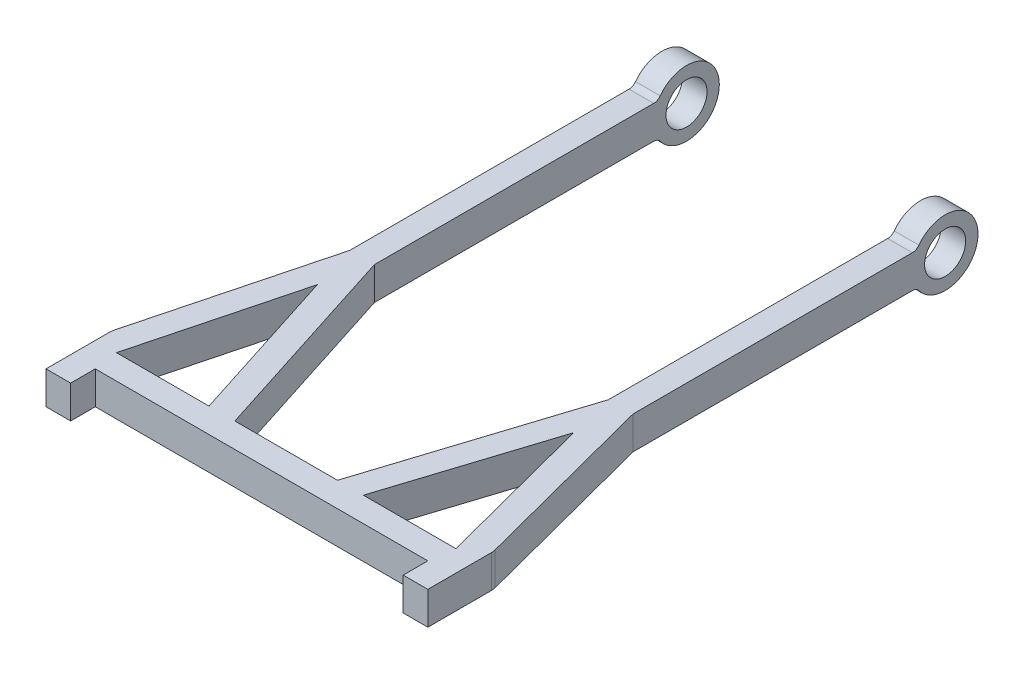
ISO-10303-21;
HEADER;
FILE_DESCRIPTION(('STEP AP214'),'2;1');
FILE_NAME('part.step','',(''),(''),'','','');
FILE_SCHEMA(('AUTOMOTIVE_DESIGN { 1 0 10303 214 1 1 1 1 }'));
ENDSEC;
DATA;
#1=APPLICATION_CONTEXT('core data for automotive mechanical design processes');
#2=APPLICATION_PROTOCOL_DEFINITION('international standard','automotive_design',2000,#1);
#3=PRODUCT_CONTEXT('',#1,'mechanical');
#4=PRODUCT('Part','Part','',(#3));
#5=PRODUCT_RELATED_PRODUCT_CATEGORY('part','',(#4));
#6=PRODUCT_DEFINITION_FORMATION('','',#4);
#7=PRODUCT_DEFINITION_CONTEXT('part definition',#1,'design');
#8=PRODUCT_DEFINITION('design','',#6,#7);
#9=PRODUCT_DEFINITION_SHAPE('','',#8);
#10=(LENGTH_UNIT() NAMED_UNIT(*) SI_UNIT(.MILLI.,.METRE.));
#11=(NAMED_UNIT(*) PLANE_ANGLE_UNIT() SI_UNIT($,.RADIAN.));
#12=(NAMED_UNIT(*) SI_UNIT($,.STERADIAN.) SOLID_ANGLE_UNIT());
#13=UNCERTAINTY_MEASURE_WITH_UNIT(LENGTH_MEASURE(1.E-05),#10,'distance_accuracy_value','');
#14=(GEOMETRIC_REPRESENTATION_CONTEXT(3) GLOBAL_UNCERTAINTY_ASSIGNED_CONTEXT((#13)) GLOBAL_UNIT_ASSIGNED_CONTEXT((#10,
#11,#12)) REPRESENTATION_CONTEXT('',''));
#15=CARTESIAN_POINT('',(0.,0.,0.));
#16=DIRECTION('',(0.,0.,1.));
#17=DIRECTION('',(1.,0.,0.));
#18=AXIS2_PLACEMENT_3D('',#15,#16,#17);
#19=CARTESIAN_POINT('',(-10.625,1.,-1.62171189199843));
#20=DIRECTION('',(0.,-1.,0.));
#21=DIRECTION('',(0.,0.,-1.));
#22=AXIS2_PLACEMENT_3D('',#19,#20,#21);
#23=PLANE('',#22);
#24=DIRECTION('',(0.,0.,1.));
#25=VECTOR('',#24,1.);
#26=CARTESIAN_POINT('',(-8.625,1.,-30.25));
#27=LINE('',#26,#25);
#28=CARTESIAN_POINT('',(-8.625,1.,-30.25));
#29=VERTEX_POINT('',#28);
#30=CARTESIAN_POINT('',(-8.625,1.,-13.25));
#31=VERTEX_POINT('',#30);
#32=EDGE_CURVE('E264',#29,#31,#27,.T.);
#33=ORIENTED_EDGE('',*,*,#32,.T.);
#34=DIRECTION('',(-0.252421897147003,0.,0.967617272396844));
#35=VECTOR('',#34,1.);
#36=CARTESIAN_POINT('',(-11.5926172723968,1.,-1.87413378914544));
#37=LINE('',#36,#35);
#38=CARTESIAN_POINT('',(-11.5926172723968,1.,-1.87413378914544));
#39=VERTEX_POINT('',#38);
#40=EDGE_CURVE('E408',#31,#39,#37,.T.);
#41=ORIENTED_EDGE('',*,*,#40,.T.);
#42=CARTESIAN_POINT('',(-10.625,1.,-1.62171189199843));
#43=DIRECTION('',(0.,1.,0.));
#44=DIRECTION('',(0.,0.,-1.));
#45=AXIS2_PLACEMENT_3D('',#42,#43,#44);
#46=CIRCLE('',#45,0.999999999999999);
#47=CARTESIAN_POINT('',(-11.625,1.,-1.62171189199843));
#48=VERTEX_POINT('',#47);
#49=EDGE_CURVE('E411',#39,#48,#46,.T.);
#50=ORIENTED_EDGE('',*,*,#49,.T.);
#51=DIRECTION('',(0.,0.,1.));
#52=VECTOR('',#51,1.);
#53=CARTESIAN_POINT('',(-11.625,1.,0.75));
#54=LINE('',#53,#52);
#55=CARTESIAN_POINT('',(-11.625,1.,2.25));
#56=VERTEX_POINT('',#55);
#57=EDGE_CURVE('E413',#48,#56,#54,.T.);
#58=ORIENTED_EDGE('',*,*,#57,.T.);
#59=DIRECTION('',(1.,0.,0.));
#60=VECTOR('',#59,1.);
#61=CARTESIAN_POINT('',(-11.625,1.,2.25));
#62=LINE('',#61,#60);
#63=CARTESIAN_POINT('',(-10.125,1.,2.25));
#64=VERTEX_POINT('',#63);
#65=EDGE_CURVE('E415',#56,#64,#62,.T.);
#66=ORIENTED_EDGE('',*,*,#65,.T.);
#67=DIRECTION('',(0.,0.,-1.));
#68=VECTOR('',#67,1.);
#69=CARTESIAN_POINT('',(-10.125,1.,2.25));
#70=LINE('',#69,#68);
#71=CARTESIAN_POINT('',(-10.125,1.,0.75));
#72=VERTEX_POINT('',#71);
#73=EDGE_CURVE('E417',#64,#72,#70,.T.);
#74=ORIENTED_EDGE('',*,*,#73,.T.);
#75=DIRECTION('',(1.,0.,0.));
#76=VECTOR('',#75,1.);
#77=CARTESIAN_POINT('',(-10.125,1.,0.75));
#78=LINE('',#77,#76);
#79=CARTESIAN_POINT('',(10.125,1.,0.75));
#80=VERTEX_POINT('',#79);
#81=EDGE_CURVE('E419',#72,#80,#78,.T.);
#82=ORIENTED_EDGE('',*,*,#81,.T.);
#83=DIRECTION('',(0.,0.,-1.));
#84=VECTOR('',#83,1.);
#85=CARTESIAN_POINT('',(10.125,1.,2.25));
#86=LINE('',#85,#84);
#87=CARTESIAN_POINT('',(10.125,1.,2.25));
#88=VERTEX_POINT('',#87);
#89=EDGE_CURVE('E330',#88,#80,#86,.T.);
#90=ORIENTED_EDGE('',*,*,#89,.F.);
#91=DIRECTION('',(-1.,0.,0.));
#92=VECTOR('',#91,1.);
#93=CARTESIAN_POINT('',(11.625,1.,2.25));
#94=LINE('',#93,#92);
#95=CARTESIAN_POINT('',(11.625,1.,2.25));
#96=VERTEX_POINT('',#95);
#97=EDGE_CURVE('E333',#96,#88,#94,.T.);
#98=ORIENTED_EDGE('',*,*,#97,.F.);
#99=DIRECTION('',(0.,0.,1.));
#100=VECTOR('',#99,1.);
#101=CARTESIAN_POINT('',(11.625,1.,2.25));
#102=LINE('',#101,#100);
#103=CARTESIAN_POINT('',(11.625,1.,-1.62171189199843));
#104=VERTEX_POINT('',#103);
#105=EDGE_CURVE('E336',#104,#96,#102,.T.);
#106=ORIENTED_EDGE('',*,*,#105,.F.);
#107=CARTESIAN_POINT('',(10.625,1.,-1.62171189199843));
#108=DIRECTION('',(0.,-1.,0.));
#109=DIRECTION('',(0.,0.,-1.));
#110=AXIS2_PLACEMENT_3D('',#107,#108,#109);
#111=CIRCLE('',#110,0.999999999999999);
#112=CARTESIAN_POINT('',(11.5926172723968,1.,-1.87413378914544));
#113=VERTEX_POINT('',#112);
#114=EDGE_CURVE('E339',#113,#104,#111,.T.);
#115=ORIENTED_EDGE('',*,*,#114,.F.);
#116=DIRECTION('',(0.252421897147003,0.,0.967617272396844));
#117=VECTOR('',#116,1.);
#118=CARTESIAN_POINT('',(11.5926172723968,1.,-1.87413378914544));
#119=LINE('',#118,#117);
#120=CARTESIAN_POINT('',(8.625,1.,-13.25));
#121=VERTEX_POINT('',#120);
#122=EDGE_CURVE('E342',#121,#113,#119,.T.);
#123=ORIENTED_EDGE('',*,*,#122,.F.);
#124=DIRECTION('',(0.,0.,1.));
#125=VECTOR('',#124,1.);
#126=CARTESIAN_POINT('',(8.625,1.,-30.25));
#127=LINE('',#126,#125);
#128=CARTESIAN_POINT('',(8.625,1.,-30.25));
#129=VERTEX_POINT('',#128);
#130=EDGE_CURVE('E318',#129,#121,#127,.T.);
#131=ORIENTED_EDGE('',*,*,#130,.F.);
#132=DIRECTION('',(1.,0.,0.));
#133=VECTOR('',#132,1.);
#134=CARTESIAN_POINT('',(8.625,1.,-30.25));
#135=LINE('',#134,#133);
#136=CARTESIAN_POINT('',(7.125,1.,-30.25));
#137=VERTEX_POINT('',#136);
#138=EDGE_CURVE('E321',#137,#129,#135,.T.);
#139=ORIENTED_EDGE('',*,*,#138,.F.);
#140=DIRECTION('',(0.,0.,-1.));
#141=VECTOR('',#140,1.);
#142=CARTESIAN_POINT('',(7.125,1.,-30.25));
#143=LINE('',#142,#141);
#144=CARTESIAN_POINT('',(7.125,1.,-13.25));
#145=VERTEX_POINT('',#144);
#146=EDGE_CURVE('E324',#145,#137,#143,.T.);
#147=ORIENTED_EDGE('',*,*,#146,.F.);
#148=DIRECTION('',(0.304775727103784,0.,-0.952424147199324));
#149=VECTOR('',#148,1.);
#150=CARTESIAN_POINT('',(3.125,1.,-0.75));
#151=LINE('',#150,#149);
#152=CARTESIAN_POINT('',(3.125,1.,-0.75));
#153=VERTEX_POINT('',#152);
#154=EDGE_CURVE('E327',#153,#145,#151,.T.);
#155=ORIENTED_EDGE('',*,*,#154,.F.);
#156=DIRECTION('',(-1.,0.,0.));
#157=VECTOR('',#156,1.);
#158=CARTESIAN_POINT('',(-3.125,1.,-0.75));
#159=LINE('',#158,#157);
#160=CARTESIAN_POINT('',(-3.125,1.,-0.75));
#161=VERTEX_POINT('',#160);
#162=EDGE_CURVE('E421',#153,#161,#159,.T.);
#163=ORIENTED_EDGE('',*,*,#162,.T.);
#164=DIRECTION('',(-0.304775727103784,0.,-0.952424147199324));
#165=VECTOR('',#164,1.);
#166=CARTESIAN_POINT('',(-3.125,1.,-0.75));
#167=LINE('',#166,#165);
#168=CARTESIAN_POINT('',(-7.125,1.,-13.25));
#169=VERTEX_POINT('',#168);
#170=EDGE_CURVE('E423',#161,#169,#167,.T.);
#171=ORIENTED_EDGE('',*,*,#170,.T.);
#172=DIRECTION('',(0.,0.,-1.));
#173=VECTOR('',#172,1.);
#174=CARTESIAN_POINT('',(-7.125,1.,-30.25));
#175=LINE('',#174,#173);
#176=CARTESIAN_POINT('',(-7.125,1.,-30.25));
#177=VERTEX_POINT('',#176);
#178=EDGE_CURVE('E425',#169,#177,#175,.T.);
#179=ORIENTED_EDGE('',*,*,#178,.T.);
#180=DIRECTION('',(-1.,0.,0.));
#181=VECTOR('',#180,1.);
#182=CARTESIAN_POINT('',(-8.625,1.,-30.25));
#183=LINE('',#182,#181);
#184=EDGE_CURVE('E427',#177,#29,#183,.T.);
#185=ORIENTED_EDGE('',*,*,#184,.T.);
#186=EDGE_LOOP('',(#33,#41,#50,#58,#66,#74,#82,#90,#98,#106,#115,#123,#131,#139,#147,#155,#163,
#171,#179,#185));
#187=FACE_BOUND('',#186,.T.);
#188=DIRECTION('',(1.,0.,0.));
#189=VECTOR('',#188,1.);
#190=CARTESIAN_POINT('',(-10.335669870782,1.,-0.750000000000001));
#191=LINE('',#190,#189);
#192=CARTESIAN_POINT('',(-10.335669870782,1.,-0.750000000000001));
#193=VERTEX_POINT('',#192);
#194=CARTESIAN_POINT('',(-4.6999285698088,1.,-0.75));
#195=VERTEX_POINT('',#194);
#196=EDGE_CURVE('E388',#193,#195,#191,.T.);
#197=ORIENTED_EDGE('',*,*,#196,.F.);
#198=DIRECTION('',(-0.252421897147002,0.,0.967617272396844));
#199=VECTOR('',#198,1.);
#200=CARTESIAN_POINT('',(-7.80464832842877,1.,-10.4522492456874));
#201=LINE('',#200,#199);
#202=CARTESIAN_POINT('',(-7.80464832842877,1.,-10.4522492456874));
#203=VERTEX_POINT('',#202);
#204=EDGE_CURVE('E393',#203,#193,#201,.T.);
#205=ORIENTED_EDGE('',*,*,#204,.F.);
#206=DIRECTION('',(-0.304775727103784,0.,-0.952424147199324));
#207=VECTOR('',#206,1.);
#208=CARTESIAN_POINT('',(-4.6999285698088,1.,-0.75));
#209=LINE('',#208,#207);
#210=EDGE_CURVE('E390',#195,#203,#209,.T.);
#211=ORIENTED_EDGE('',*,*,#210,.F.);
#212=EDGE_LOOP('',(#197,#205,#211));
#213=FACE_BOUND('',#212,.T.);
#214=DIRECTION('',(0.252421897147002,0.,0.967617272396844));
#215=VECTOR('',#214,1.);
#216=CARTESIAN_POINT('',(7.80464832842877,1.,-10.4522492456874));
#217=LINE('',#216,#215);
#218=CARTESIAN_POINT('',(7.80464832842877,1.,-10.4522492456874));
#219=VERTEX_POINT('',#218);
#220=CARTESIAN_POINT('',(10.335669870782,1.,-0.750000000000001));
#221=VERTEX_POINT('',#220);
#222=EDGE_CURVE('E297',#219,#221,#217,.T.);
#223=ORIENTED_EDGE('',*,*,#222,.T.);
#224=DIRECTION('',(-1.,0.,0.));
#225=VECTOR('',#224,1.);
#226=CARTESIAN_POINT('',(10.335669870782,1.,-0.750000000000001));
#227=LINE('',#226,#225);
#228=CARTESIAN_POINT('',(4.6999285698088,1.,-0.75));
#229=VERTEX_POINT('',#228);
#230=EDGE_CURVE('E294',#221,#229,#227,.T.);
#231=ORIENTED_EDGE('',*,*,#230,.T.);
#232=DIRECTION('',(0.304775727103784,0.,-0.952424147199324));
#233=VECTOR('',#232,1.);
#234=CARTESIAN_POINT('',(4.6999285698088,1.,-0.75));
#235=LINE('',#234,#233);
#236=EDGE_CURVE('E301',#229,#219,#235,.T.);
#237=ORIENTED_EDGE('',*,*,#236,.T.);
#238=EDGE_LOOP('',(#223,#231,#237));
#239=FACE_BOUND('',#238,.T.);
#240=ADVANCED_FACE('F39',(#187,#213,#239),#23,.F.);
#241=CARTESIAN_POINT('',(-10.625,-1.,-1.62171189199843));
#242=DIRECTION('',(0.,-1.,0.));
#243=DIRECTION('',(0.,0.,-1.));
#244=AXIS2_PLACEMENT_3D('',#241,#242,#243);
#245=PLANE('',#244);
#246=DIRECTION('',(0.,0.,1.));
#247=VECTOR('',#246,1.);
#248=CARTESIAN_POINT('',(-8.625,-1.,-30.25));
#249=LINE('',#248,#247);
#250=CARTESIAN_POINT('',(-8.625,-1.,-30.25));
#251=VERTEX_POINT('',#250);
#252=CARTESIAN_POINT('',(-8.625,-1.,-13.25));
#253=VERTEX_POINT('',#252);
#254=EDGE_CURVE('E406',#251,#253,#249,.T.);
#255=ORIENTED_EDGE('',*,*,#254,.F.);
#256=DIRECTION('',(-1.,0.,0.));
#257=VECTOR('',#256,1.);
#258=CARTESIAN_POINT('',(-8.625,-1.,-30.25));
#259=LINE('',#258,#257);
#260=CARTESIAN_POINT('',(-7.125,-1.,-30.25));
#261=VERTEX_POINT('',#260);
#262=EDGE_CURVE('E409',#261,#251,#259,.T.);
#263=ORIENTED_EDGE('',*,*,#262,.F.);
#264=DIRECTION('',(0.,0.,-1.));
#265=VECTOR('',#264,1.);
#266=CARTESIAN_POINT('',(-7.125,-1.,-30.25));
#267=LINE('',#266,#265);
#268=CARTESIAN_POINT('',(-7.125,-1.,-13.25));
#269=VERTEX_POINT('',#268);
#270=EDGE_CURVE('E448',#269,#261,#267,.T.);
#271=ORIENTED_EDGE('',*,*,#270,.F.);
#272=DIRECTION('',(-0.304775727103784,0.,-0.952424147199324));
#273=VECTOR('',#272,1.);
#274=CARTESIAN_POINT('',(-3.125,-1.,-0.75));
#275=LINE('',#274,#273);
#276=CARTESIAN_POINT('',(-3.125,-1.,-0.75));
#277=VERTEX_POINT('',#276);
#278=EDGE_CURVE('E446',#277,#269,#275,.T.);
#279=ORIENTED_EDGE('',*,*,#278,.F.);
#280=DIRECTION('',(-1.,0.,0.));
#281=VECTOR('',#280,1.);
#282=CARTESIAN_POINT('',(-3.125,-1.,-0.75));
#283=LINE('',#282,#281);
#284=CARTESIAN_POINT('',(3.125,-1.,-0.75));
#285=VERTEX_POINT('',#284);
#286=EDGE_CURVE('E444',#285,#277,#283,.T.);
#287=ORIENTED_EDGE('',*,*,#286,.F.);
#288=DIRECTION('',(0.304775727103784,0.,-0.952424147199324));
#289=VECTOR('',#288,1.);
#290=CARTESIAN_POINT('',(3.125,-1.,-0.75));
#291=LINE('',#290,#289);
#292=CARTESIAN_POINT('',(7.125,-1.,-13.25));
#293=VERTEX_POINT('',#292);
#294=EDGE_CURVE('E354',#285,#293,#291,.T.);
#295=ORIENTED_EDGE('',*,*,#294,.T.);
#296=DIRECTION('',(0.,0.,-1.));
#297=VECTOR('',#296,1.);
#298=CARTESIAN_POINT('',(7.125,-1.,-30.25));
#299=LINE('',#298,#297);
#300=CARTESIAN_POINT('',(7.125,-1.,-30.25));
#301=VERTEX_POINT('',#300);
#302=EDGE_CURVE('E351',#293,#301,#299,.T.);
#303=ORIENTED_EDGE('',*,*,#302,.T.);
#304=DIRECTION('',(1.,0.,0.));
#305=VECTOR('',#304,1.);
#306=CARTESIAN_POINT('',(8.625,-1.,-30.25));
#307=LINE('',#306,#305);
#308=CARTESIAN_POINT('',(8.625,-1.,-30.25));
#309=VERTEX_POINT('',#308);
#310=EDGE_CURVE('E348',#301,#309,#307,.T.);
#311=ORIENTED_EDGE('',*,*,#310,.T.);
#312=DIRECTION('',(0.,0.,1.));
#313=VECTOR('',#312,1.);
#314=CARTESIAN_POINT('',(8.625,-1.,-30.25));
#315=LINE('',#314,#313);
#316=CARTESIAN_POINT('',(8.625,-1.,-13.25));
#317=VERTEX_POINT('',#316);
#318=EDGE_CURVE('E317',#309,#317,#315,.T.);
#319=ORIENTED_EDGE('',*,*,#318,.T.);
#320=DIRECTION('',(0.252421897147003,0.,0.967617272396844));
#321=VECTOR('',#320,1.);
#322=CARTESIAN_POINT('',(11.5926172723968,-1.,-1.87413378914544));
#323=LINE('',#322,#321);
#324=CARTESIAN_POINT('',(11.5926172723968,-1.,-1.87413378914544));
#325=VERTEX_POINT('',#324);
#326=EDGE_CURVE('E322',#317,#325,#323,.T.);
#327=ORIENTED_EDGE('',*,*,#326,.T.);
#328=CARTESIAN_POINT('',(10.625,-1.,-1.62171189199843));
#329=DIRECTION('',(0.,-1.,0.));
#330=DIRECTION('',(0.,0.,-1.));
#331=AXIS2_PLACEMENT_3D('',#328,#329,#330);
#332=CIRCLE('',#331,0.999999999999999);
#333=CARTESIAN_POINT('',(11.625,-1.,-1.62171189199843));
#334=VERTEX_POINT('',#333);
#335=EDGE_CURVE('E365',#325,#334,#332,.T.);
#336=ORIENTED_EDGE('',*,*,#335,.T.);
#337=DIRECTION('',(0.,0.,1.));
#338=VECTOR('',#337,1.);
#339=CARTESIAN_POINT('',(11.625,-1.,0.75));
#340=LINE('',#339,#338);
#341=CARTESIAN_POINT('',(11.625,-1.,2.25));
#342=VERTEX_POINT('',#341);
#343=EDGE_CURVE('E363',#334,#342,#340,.T.);
#344=ORIENTED_EDGE('',*,*,#343,.T.);
#345=DIRECTION('',(-1.,0.,0.));
#346=VECTOR('',#345,1.);
#347=CARTESIAN_POINT('',(11.625,-1.,2.25));
#348=LINE('',#347,#346);
#349=CARTESIAN_POINT('',(10.125,-1.,2.25));
#350=VERTEX_POINT('',#349);
#351=EDGE_CURVE('E360',#342,#350,#348,.T.);
#352=ORIENTED_EDGE('',*,*,#351,.T.);
#353=DIRECTION('',(0.,0.,-1.));
#354=VECTOR('',#353,1.);
#355=CARTESIAN_POINT('',(10.125,-1.,2.25));
#356=LINE('',#355,#354);
#357=CARTESIAN_POINT('',(10.125,-1.,0.75));
#358=VERTEX_POINT('',#357);
#359=EDGE_CURVE('E357',#350,#358,#356,.T.);
#360=ORIENTED_EDGE('',*,*,#359,.T.);
#361=DIRECTION('',(1.,0.,0.));
#362=VECTOR('',#361,1.);
#363=CARTESIAN_POINT('',(-10.125,-1.,0.75));
#364=LINE('',#363,#362);
#365=CARTESIAN_POINT('',(-10.125,-1.,0.75));
#366=VERTEX_POINT('',#365);
#367=EDGE_CURVE('E442',#366,#358,#364,.T.);
#368=ORIENTED_EDGE('',*,*,#367,.F.);
#369=DIRECTION('',(0.,0.,-1.));
#370=VECTOR('',#369,1.);
#371=CARTESIAN_POINT('',(-10.125,-1.,2.25));
#372=LINE('',#371,#370);
#373=CARTESIAN_POINT('',(-10.125,-1.,2.25));
#374=VERTEX_POINT('',#373);
#375=EDGE_CURVE('E440',#374,#366,#372,.T.);
#376=ORIENTED_EDGE('',*,*,#375,.F.);
#377=DIRECTION('',(1.,0.,0.));
#378=VECTOR('',#377,1.);
#379=CARTESIAN_POINT('',(-11.625,-1.,2.25));
#380=LINE('',#379,#378);
#381=CARTESIAN_POINT('',(-11.625,-1.,2.25));
#382=VERTEX_POINT('',#381);
#383=EDGE_CURVE('E438',#382,#374,#380,.T.);
#384=ORIENTED_EDGE('',*,*,#383,.F.);
#385=DIRECTION('',(0.,0.,1.));
#386=VECTOR('',#385,1.);
#387=CARTESIAN_POINT('',(-11.625,-1.,2.25));
#388=LINE('',#387,#386);
#389=CARTESIAN_POINT('',(-11.625,-1.,-1.62171189199843));
#390=VERTEX_POINT('',#389);
#391=EDGE_CURVE('E436',#390,#382,#388,.T.);
#392=ORIENTED_EDGE('',*,*,#391,.F.);
#393=CARTESIAN_POINT('',(-10.625,-1.,-1.62171189199843));
#394=DIRECTION('',(0.,1.,0.));
#395=DIRECTION('',(0.,0.,-1.));
#396=AXIS2_PLACEMENT_3D('',#393,#394,#395);
#397=CIRCLE('',#396,0.999999999999999);
#398=CARTESIAN_POINT('',(-11.5926172723968,-1.,-1.87413378914544));
#399=VERTEX_POINT('',#398);
#400=EDGE_CURVE('E433',#399,#390,#397,.T.);
#401=ORIENTED_EDGE('',*,*,#400,.F.);
#402=DIRECTION('',(-0.252421897147003,0.,0.967617272396844));
#403=VECTOR('',#402,1.);
#404=CARTESIAN_POINT('',(-11.5926172723968,-1.,-1.87413378914544));
#405=LINE('',#404,#403);
#406=EDGE_CURVE('E431',#253,#399,#405,.T.);
#407=ORIENTED_EDGE('',*,*,#406,.F.);
#408=EDGE_LOOP('',(#255,#263,#271,#279,#287,#295,#303,#311,#319,#327,#336,#344,#352,#360,#368,
#376,#384,#392,#401,#407));
#409=FACE_BOUND('',#408,.T.);
#410=DIRECTION('',(-0.252421897147002,0.,0.967617272396844));
#411=VECTOR('',#410,1.);
#412=CARTESIAN_POINT('',(-7.80464832842877,-1.,-10.4522492456874));
#413=LINE('',#412,#411);
#414=CARTESIAN_POINT('',(-7.80464832842877,-1.,-10.4522492456874));
#415=VERTEX_POINT('',#414);
#416=CARTESIAN_POINT('',(-10.335669870782,-1.,-0.750000000000001));
#417=VERTEX_POINT('',#416);
#418=EDGE_CURVE('E391',#415,#417,#413,.T.);
#419=ORIENTED_EDGE('',*,*,#418,.T.);
#420=DIRECTION('',(1.,0.,0.));
#421=VECTOR('',#420,1.);
#422=CARTESIAN_POINT('',(-10.335669870782,-1.,-0.750000000000001));
#423=LINE('',#422,#421);
#424=CARTESIAN_POINT('',(-4.6999285698088,-1.,-0.75));
#425=VERTEX_POINT('',#424);
#426=EDGE_CURVE('E63',#417,#425,#423,.T.);
#427=ORIENTED_EDGE('',*,*,#426,.T.);
#428=DIRECTION('',(-0.304775727103784,0.,-0.952424147199324));
#429=VECTOR('',#428,1.);
#430=CARTESIAN_POINT('',(-4.6999285698088,-1.,-0.75));
#431=LINE('',#430,#429);
#432=EDGE_CURVE('E397',#425,#415,#431,.T.);
#433=ORIENTED_EDGE('',*,*,#432,.T.);
#434=EDGE_LOOP('',(#419,#427,#433));
#435=FACE_BOUND('',#434,.T.);
#436=DIRECTION('',(-1.,0.,0.));
#437=VECTOR('',#436,1.);
#438=CARTESIAN_POINT('',(10.335669870782,-1.,-0.750000000000001));
#439=LINE('',#438,#437);
#440=CARTESIAN_POINT('',(10.335669870782,-1.,-0.750000000000001));
#441=VERTEX_POINT('',#440);
#442=CARTESIAN_POINT('',(4.6999285698088,-1.,-0.75));
#443=VERTEX_POINT('',#442);
#444=EDGE_CURVE('E287',#441,#443,#439,.T.);
#445=ORIENTED_EDGE('',*,*,#444,.F.);
#446=DIRECTION('',(0.252421897147002,0.,0.967617272396844));
#447=VECTOR('',#446,1.);
#448=CARTESIAN_POINT('',(7.80464832842877,-1.,-10.4522492456874));
#449=LINE('',#448,#447);
#450=CARTESIAN_POINT('',(7.80464832842877,-1.,-10.4522492456874));
#451=VERTEX_POINT('',#450);
#452=EDGE_CURVE('E306',#451,#441,#449,.T.);
#453=ORIENTED_EDGE('',*,*,#452,.F.);
#454=DIRECTION('',(0.304775727103784,0.,-0.952424147199324));
#455=VECTOR('',#454,1.);
#456=CARTESIAN_POINT('',(4.6999285698088,-1.,-0.75));
#457=LINE('',#456,#455);
#458=EDGE_CURVE('E298',#443,#451,#457,.T.);
#459=ORIENTED_EDGE('',*,*,#458,.F.);
#460=EDGE_LOOP('',(#445,#453,#459));
#461=FACE_BOUND('',#460,.T.);
#462=ADVANCED_FACE('F479',(#409,#435,#461),#245,.T.);
#463=CARTESIAN_POINT('',(-8.625,1.,-30.25));
#464=DIRECTION('',(1.,0.,0.));
#465=DIRECTION('',(0.,0.,-1.));
#466=AXIS2_PLACEMENT_3D('',#463,#464,#465);
#467=PLANE('',#466);
#468=CARTESIAN_POINT('',(-8.625,0.,-32.25));
#469=DIRECTION('',(1.,0.,0.));
#470=DIRECTION('',(0.,0.,-1.));
#471=AXIS2_PLACEMENT_3D('',#468,#469,#470);
#472=CIRCLE('',#471,1.25);
#473=CARTESIAN_POINT('',(-8.625,0.,-33.5));
#474=VERTEX_POINT('',#473);
#475=EDGE_CURVE('E267',#474,#474,#472,.T.);
#476=ORIENTED_EDGE('',*,*,#475,.T.);
#477=EDGE_LOOP('',(#476));
#478=FACE_BOUND('',#477,.T.);
#479=ORIENTED_EDGE('',*,*,#254,.T.);
#480=DIRECTION('',(0.,-1.,0.));
#481=VECTOR('',#480,1.);
#482=CARTESIAN_POINT('',(-8.625,1.,-13.25));
#483=LINE('',#482,#481);
#484=EDGE_CURVE('E11',#31,#253,#483,.T.);
#485=ORIENTED_EDGE('',*,*,#484,.F.);
#486=ORIENTED_EDGE('',*,*,#32,.F.);
#487=CARTESIAN_POINT('',(-8.625,1.5,-30.25));
#488=DIRECTION('',(1.,0.,0.));
#489=DIRECTION('',(0.,0.,-1.));
#490=AXIS2_PLACEMENT_3D('',#487,#488,#489);
#491=CIRCLE('',#490,0.499999999999999);
#492=CARTESIAN_POINT('',(-8.625,1.2,-30.65));
#493=VERTEX_POINT('',#492);
#494=EDGE_CURVE('E245',#29,#493,#491,.T.);
#495=ORIENTED_EDGE('',*,*,#494,.T.);
#496=CARTESIAN_POINT('',(-8.625,0.,-32.25));
#497=DIRECTION('',(1.,0.,0.));
#498=DIRECTION('',(0.,0.,-1.));
#499=AXIS2_PLACEMENT_3D('',#496,#497,#498);
#500=CIRCLE('',#499,2.);
#501=CARTESIAN_POINT('',(-8.625,-1.2,-30.65));
#502=VERTEX_POINT('',#501);
#503=EDGE_CURVE('E251',#502,#493,#500,.T.);
#504=ORIENTED_EDGE('',*,*,#503,.F.);
#505=CARTESIAN_POINT('',(-8.625,-1.5,-30.25));
#506=DIRECTION('',(1.,0.,0.));
#507=DIRECTION('',(0.,0.,-1.));
#508=AXIS2_PLACEMENT_3D('',#505,#506,#507);
#509=CIRCLE('',#508,0.499999999999999);
#510=EDGE_CURVE('E265',#502,#251,#509,.T.);
#511=ORIENTED_EDGE('',*,*,#510,.T.);
#512=EDGE_LOOP('',(#479,#485,#486,#495,#504,#511));
#513=FACE_BOUND('',#512,.T.);
#514=ADVANCED_FACE('F41',(#478,#513),#467,.F.);
#515=CARTESIAN_POINT('',(-11.5926172723968,1.,-1.87413378914544));
#516=DIRECTION('',(0.967617272396844,0.,0.252421897147003));
#517=DIRECTION('',(0.252421897147003,0.,-0.967617272396844));
#518=AXIS2_PLACEMENT_3D('',#515,#516,#517);
#519=PLANE('',#518);
#520=ORIENTED_EDGE('',*,*,#406,.T.);
#521=DIRECTION('',(0.,-1.,0.));
#522=VECTOR('',#521,1.);
#523=CARTESIAN_POINT('',(-11.5926172723968,1.,-1.87413378914544));
#524=LINE('',#523,#522);
#525=EDGE_CURVE('E48',#39,#399,#524,.T.);
#526=ORIENTED_EDGE('',*,*,#525,.F.);
#527=ORIENTED_EDGE('',*,*,#40,.F.);
#528=ORIENTED_EDGE('',*,*,#484,.T.);
#529=EDGE_LOOP('',(#520,#526,#527,#528));
#530=FACE_BOUND('',#529,.T.);
#531=ADVANCED_FACE('F495',(#530),#519,.F.);
#532=CARTESIAN_POINT('',(-10.625,1.,-1.62171189199843));
#533=DIRECTION('',(0.,-1.,0.));
#534=DIRECTION('',(0.,0.,-1.));
#535=AXIS2_PLACEMENT_3D('',#532,#533,#534);
#536=CYLINDRICAL_SURFACE('',#535,0.999999999999999);
#537=ORIENTED_EDGE('',*,*,#400,.T.);
#538=DIRECTION('',(0.,-1.,0.));
#539=VECTOR('',#538,1.);
#540=CARTESIAN_POINT('',(-11.625,1.,-1.62171189199843));
#541=LINE('',#540,#539);
#542=EDGE_CURVE('E467',#48,#390,#541,.T.);
#543=ORIENTED_EDGE('',*,*,#542,.F.);
#544=ORIENTED_EDGE('',*,*,#49,.F.);
#545=ORIENTED_EDGE('',*,*,#525,.T.);
#546=EDGE_LOOP('',(#537,#543,#544,#545));
#547=FACE_BOUND('',#546,.T.);
#548=ADVANCED_FACE('F475',(#547),#536,.T.);
#549=CARTESIAN_POINT('',(-11.625,1.,2.25));
#550=DIRECTION('',(1.,0.,0.));
#551=DIRECTION('',(0.,0.,-1.));
#552=AXIS2_PLACEMENT_3D('',#549,#550,#551);
#553=PLANE('',#552);
#554=ORIENTED_EDGE('',*,*,#391,.T.);
#555=DIRECTION('',(0.,-1.,0.));
#556=VECTOR('',#555,1.);
#557=CARTESIAN_POINT('',(-11.625,1.,2.25));
#558=LINE('',#557,#556);
#559=EDGE_CURVE('E464',#56,#382,#558,.T.);
#560=ORIENTED_EDGE('',*,*,#559,.F.);
#561=ORIENTED_EDGE('',*,*,#57,.F.);
#562=ORIENTED_EDGE('',*,*,#542,.T.);
#563=EDGE_LOOP('',(#554,#560,#561,#562));
#564=FACE_BOUND('',#563,.T.);
#565=ADVANCED_FACE('F485',(#564),#553,.F.);
#566=CARTESIAN_POINT('',(-11.625,1.,2.25));
#567=DIRECTION('',(0.,0.,-1.));
#568=DIRECTION('',(-1.,0.,0.));
#569=AXIS2_PLACEMENT_3D('',#566,#567,#568);
#570=PLANE('',#569);
#571=ORIENTED_EDGE('',*,*,#383,.T.);
#572=DIRECTION('',(0.,-1.,0.));
#573=VECTOR('',#572,1.);
#574=CARTESIAN_POINT('',(-10.125,1.,2.25));
#575=LINE('',#574,#573);
#576=EDGE_CURVE('E461',#64,#374,#575,.T.);
#577=ORIENTED_EDGE('',*,*,#576,.F.);
#578=ORIENTED_EDGE('',*,*,#65,.F.);
#579=ORIENTED_EDGE('',*,*,#559,.T.);
#580=EDGE_LOOP('',(#571,#577,#578,#579));
#581=FACE_BOUND('',#580,.T.);
#582=ADVANCED_FACE('F489',(#581),#570,.F.);
#583=CARTESIAN_POINT('',(-10.125,1.,2.25));
#584=DIRECTION('',(-1.,0.,0.));
#585=DIRECTION('',(0.,0.,1.));
#586=AXIS2_PLACEMENT_3D('',#583,#584,#585);
#587=PLANE('',#586);
#588=ORIENTED_EDGE('',*,*,#375,.T.);
#589=DIRECTION('',(0.,-1.,0.));
#590=VECTOR('',#589,1.);
#591=CARTESIAN_POINT('',(-10.125,1.,0.75));
#592=LINE('',#591,#590);
#593=EDGE_CURVE('E458',#72,#366,#592,.T.);
#594=ORIENTED_EDGE('',*,*,#593,.F.);
#595=ORIENTED_EDGE('',*,*,#73,.F.);
#596=ORIENTED_EDGE('',*,*,#576,.T.);
#597=EDGE_LOOP('',(#588,#594,#595,#596));
#598=FACE_BOUND('',#597,.T.);
#599=ADVANCED_FACE('F574',(#598),#587,.F.);
#600=CARTESIAN_POINT('',(-10.125,1.,0.75));
#601=DIRECTION('',(0.,0.,-1.));
#602=DIRECTION('',(-1.,0.,0.));
#603=AXIS2_PLACEMENT_3D('',#600,#601,#602);
#604=PLANE('',#603);
#605=ORIENTED_EDGE('',*,*,#367,.T.);
#606=DIRECTION('',(0.,-1.,0.));
#607=VECTOR('',#606,1.);
#608=CARTESIAN_POINT('',(10.125,1.,0.75));
#609=LINE('',#608,#607);
#610=EDGE_CURVE('E380',#80,#358,#609,.T.);
#611=ORIENTED_EDGE('',*,*,#610,.F.);
#612=ORIENTED_EDGE('',*,*,#81,.F.);
#613=ORIENTED_EDGE('',*,*,#593,.T.);
#614=EDGE_LOOP('',(#605,#611,#612,#613));
#615=FACE_BOUND('',#614,.T.);
#616=ADVANCED_FACE('F571',(#615),#604,.F.);
#617=CARTESIAN_POINT('',(-3.125,1.,-0.75));
#618=DIRECTION('',(0.,0.,1.));
#619=DIRECTION('',(1.,0.,0.));
#620=AXIS2_PLACEMENT_3D('',#617,#618,#619);
#621=PLANE('',#620);
#622=ORIENTED_EDGE('',*,*,#286,.T.);
#623=DIRECTION('',(0.,-1.,0.));
#624=VECTOR('',#623,1.);
#625=CARTESIAN_POINT('',(-3.125,1.,-0.75));
#626=LINE('',#625,#624);
#627=EDGE_CURVE('E455',#161,#277,#626,.T.);
#628=ORIENTED_EDGE('',*,*,#627,.F.);
#629=ORIENTED_EDGE('',*,*,#162,.F.);
#630=DIRECTION('',(0.,-1.,0.));
#631=VECTOR('',#630,1.);
#632=CARTESIAN_POINT('',(3.125,1.,-0.75));
#633=LINE('',#632,#631);
#634=EDGE_CURVE('E383',#153,#285,#633,.T.);
#635=ORIENTED_EDGE('',*,*,#634,.T.);
#636=EDGE_LOOP('',(#622,#628,#629,#635));
#637=FACE_BOUND('',#636,.T.);
#638=ADVANCED_FACE('F582',(#637),#621,.F.);
#639=CARTESIAN_POINT('',(-3.125,1.,-0.75));
#640=DIRECTION('',(-0.952424147199324,0.,0.304775727103784));
#641=DIRECTION('',(0.304775727103784,0.,0.952424147199324));
#642=AXIS2_PLACEMENT_3D('',#639,#640,#641);
#643=PLANE('',#642);
#644=ORIENTED_EDGE('',*,*,#278,.T.);
#645=DIRECTION('',(0.,-1.,0.));
#646=VECTOR('',#645,1.);
#647=CARTESIAN_POINT('',(-7.125,1.,-13.25));
#648=LINE('',#647,#646);
#649=EDGE_CURVE('E429',#169,#269,#648,.T.);
#650=ORIENTED_EDGE('',*,*,#649,.F.);
#651=ORIENTED_EDGE('',*,*,#170,.F.);
#652=ORIENTED_EDGE('',*,*,#627,.T.);
#653=EDGE_LOOP('',(#644,#650,#651,#652));
#654=FACE_BOUND('',#653,.T.);
#655=ADVANCED_FACE('F599',(#654),#643,.F.);
#656=CARTESIAN_POINT('',(-7.125,1.,-30.25));
#657=DIRECTION('',(-1.,0.,0.));
#658=DIRECTION('',(0.,0.,1.));
#659=AXIS2_PLACEMENT_3D('',#656,#657,#658);
#660=PLANE('',#659);
#661=CARTESIAN_POINT('',(-7.125,0.,-32.25));
#662=DIRECTION('',(-1.,0.,0.));
#663=DIRECTION('',(0.,0.,1.));
#664=AXIS2_PLACEMENT_3D('',#661,#662,#663);
#665=CIRCLE('',#664,1.25);
#666=CARTESIAN_POINT('',(-7.125,0.,-31.));
#667=VERTEX_POINT('',#666);
#668=EDGE_CURVE('E507',#667,#667,#665,.T.);
#669=ORIENTED_EDGE('',*,*,#668,.T.);
#670=EDGE_LOOP('',(#669));
#671=FACE_BOUND('',#670,.T.);
#672=ORIENTED_EDGE('',*,*,#270,.T.);
#673=CARTESIAN_POINT('',(-7.125,-1.5,-30.25));
#674=DIRECTION('',(-1.,0.,0.));
#675=DIRECTION('',(0.,0.,1.));
#676=AXIS2_PLACEMENT_3D('',#673,#674,#675);
#677=CIRCLE('',#676,0.499999999999999);
#678=CARTESIAN_POINT('',(-7.125,-1.2,-30.65));
#679=VERTEX_POINT('',#678);
#680=EDGE_CURVE('E283',#261,#679,#677,.T.);
#681=ORIENTED_EDGE('',*,*,#680,.T.);
#682=CARTESIAN_POINT('',(-7.125,0.,-32.25));
#683=DIRECTION('',(-1.,0.,0.));
#684=DIRECTION('',(0.,0.,1.));
#685=AXIS2_PLACEMENT_3D('',#682,#683,#684);
#686=CIRCLE('',#685,2.);
#687=CARTESIAN_POINT('',(-7.125,1.2,-30.65));
#688=VERTEX_POINT('',#687);
#689=EDGE_CURVE('E501',#688,#679,#686,.T.);
#690=ORIENTED_EDGE('',*,*,#689,.F.);
#691=CARTESIAN_POINT('',(-7.125,1.5,-30.25));
#692=DIRECTION('',(-1.,0.,0.));
#693=DIRECTION('',(0.,0.,1.));
#694=AXIS2_PLACEMENT_3D('',#691,#692,#693);
#695=CIRCLE('',#694,0.499999999999999);
#696=EDGE_CURVE('E247',#688,#177,#695,.T.);
#697=ORIENTED_EDGE('',*,*,#696,.T.);
#698=ORIENTED_EDGE('',*,*,#178,.F.);
#699=ORIENTED_EDGE('',*,*,#649,.T.);
#700=EDGE_LOOP('',(#672,#681,#690,#697,#698,#699));
#701=FACE_BOUND('',#700,.T.);
#702=ADVANCED_FACE('F596',(#671,#701),#660,.F.);
#703=CARTESIAN_POINT('',(-10.335669870782,1.,-0.750000000000001));
#704=DIRECTION('',(0.,0.,-1.));
#705=DIRECTION('',(-1.,0.,0.));
#706=AXIS2_PLACEMENT_3D('',#703,#704,#705);
#707=PLANE('',#706);
#708=ORIENTED_EDGE('',*,*,#426,.F.);
#709=DIRECTION('',(0.,-1.,0.));
#710=VECTOR('',#709,1.);
#711=CARTESIAN_POINT('',(-10.335669870782,1.,-0.750000000000001));
#712=LINE('',#711,#710);
#713=EDGE_CURVE('E395',#193,#417,#712,.T.);
#714=ORIENTED_EDGE('',*,*,#713,.F.);
#715=ORIENTED_EDGE('',*,*,#196,.T.);
#716=DIRECTION('',(0.,-1.,0.));
#717=VECTOR('',#716,1.);
#718=CARTESIAN_POINT('',(-4.6999285698088,1.,-0.75));
#719=LINE('',#718,#717);
#720=EDGE_CURVE('E404',#195,#425,#719,.T.);
#721=ORIENTED_EDGE('',*,*,#720,.T.);
#722=EDGE_LOOP('',(#708,#714,#715,#721));
#723=FACE_BOUND('',#722,.T.);
#724=ADVANCED_FACE('F593',(#723),#707,.T.);
#725=CARTESIAN_POINT('',(-4.6999285698088,1.,-0.75));
#726=DIRECTION('',(-0.952424147199324,0.,0.304775727103784));
#727=DIRECTION('',(0.304775727103784,0.,0.952424147199324));
#728=AXIS2_PLACEMENT_3D('',#725,#726,#727);
#729=PLANE('',#728);
#730=ORIENTED_EDGE('',*,*,#432,.F.);
#731=ORIENTED_EDGE('',*,*,#720,.F.);
#732=ORIENTED_EDGE('',*,*,#210,.T.);
#733=DIRECTION('',(0.,-1.,0.));
#734=VECTOR('',#733,1.);
#735=CARTESIAN_POINT('',(-7.80464832842877,1.,-10.4522492456874));
#736=LINE('',#735,#734);
#737=EDGE_CURVE('E55',#203,#415,#736,.T.);
#738=ORIENTED_EDGE('',*,*,#737,.T.);
#739=EDGE_LOOP('',(#730,#731,#732,#738));
#740=FACE_BOUND('',#739,.T.);
#741=ADVANCED_FACE('F781',(#740),#729,.T.);
#742=CARTESIAN_POINT('',(-7.80464832842877,1.,-10.4522492456874));
#743=DIRECTION('',(0.967617272396844,0.,0.252421897147002));
#744=DIRECTION('',(0.252421897147002,0.,-0.967617272396844));
#745=AXIS2_PLACEMENT_3D('',#742,#743,#744);
#746=PLANE('',#745);
#747=ORIENTED_EDGE('',*,*,#418,.F.);
#748=ORIENTED_EDGE('',*,*,#737,.F.);
#749=ORIENTED_EDGE('',*,*,#204,.T.);
#750=ORIENTED_EDGE('',*,*,#713,.T.);
#751=EDGE_LOOP('',(#747,#748,#749,#750));
#752=FACE_BOUND('',#751,.T.);
#753=ADVANCED_FACE('F779',(#752),#746,.T.);
#754=CARTESIAN_POINT('',(8.625,1.,-30.25));
#755=DIRECTION('',(1.,0.,0.));
#756=DIRECTION('',(0.,0.,-1.));
#757=AXIS2_PLACEMENT_3D('',#754,#755,#756);
#758=PLANE('',#757);
#759=CARTESIAN_POINT('',(8.625,0.,-32.25));
#760=DIRECTION('',(1.,0.,0.));
#761=DIRECTION('',(0.,0.,-1.));
#762=AXIS2_PLACEMENT_3D('',#759,#760,#761);
#763=CIRCLE('',#762,1.25);
#764=CARTESIAN_POINT('',(8.625,0.,-33.5));
#765=VERTEX_POINT('',#764);
#766=EDGE_CURVE('E510',#765,#765,#763,.T.);
#767=ORIENTED_EDGE('',*,*,#766,.F.);
#768=EDGE_LOOP('',(#767));
#769=FACE_BOUND('',#768,.T.);
#770=ORIENTED_EDGE('',*,*,#318,.F.);
#771=CARTESIAN_POINT('',(8.625,-1.5,-30.25));
#772=DIRECTION('',(1.,0.,0.));
#773=DIRECTION('',(0.,0.,-1.));
#774=AXIS2_PLACEMENT_3D('',#771,#772,#773);
#775=CIRCLE('',#774,0.499999999999999);
#776=CARTESIAN_POINT('',(8.625,-1.2,-30.65));
#777=VERTEX_POINT('',#776);
#778=EDGE_CURVE('E278',#309,#777,#775,.F.);
#779=ORIENTED_EDGE('',*,*,#778,.T.);
#780=CARTESIAN_POINT('',(8.625,0.,-32.25));
#781=DIRECTION('',(1.,0.,0.));
#782=DIRECTION('',(0.,0.,-1.));
#783=AXIS2_PLACEMENT_3D('',#780,#781,#782);
#784=CIRCLE('',#783,2.);
#785=CARTESIAN_POINT('',(8.625,1.2,-30.65));
#786=VERTEX_POINT('',#785);
#787=EDGE_CURVE('E282',#786,#777,#784,.F.);
#788=ORIENTED_EDGE('',*,*,#787,.F.);
#789=CARTESIAN_POINT('',(8.625,1.5,-30.25));
#790=DIRECTION('',(1.,0.,0.));
#791=DIRECTION('',(0.,0.,-1.));
#792=AXIS2_PLACEMENT_3D('',#789,#790,#791);
#793=CIRCLE('',#792,0.499999999999999);
#794=EDGE_CURVE('E284',#786,#129,#793,.F.);
#795=ORIENTED_EDGE('',*,*,#794,.T.);
#796=ORIENTED_EDGE('',*,*,#130,.T.);
#797=DIRECTION('',(0.,-1.,0.));
#798=VECTOR('',#797,1.);
#799=CARTESIAN_POINT('',(8.625,1.,-13.25));
#800=LINE('',#799,#798);
#801=EDGE_CURVE('E345',#121,#317,#800,.T.);
#802=ORIENTED_EDGE('',*,*,#801,.T.);
#803=EDGE_LOOP('',(#770,#779,#788,#795,#796,#802));
#804=FACE_BOUND('',#803,.T.);
#805=ADVANCED_FACE('F523',(#769,#804),#758,.T.);
#806=CARTESIAN_POINT('',(7.125,1.,-30.25));
#807=DIRECTION('',(-1.,0.,0.));
#808=DIRECTION('',(0.,0.,1.));
#809=AXIS2_PLACEMENT_3D('',#806,#807,#808);
#810=PLANE('',#809);
#811=CARTESIAN_POINT('',(7.125,0.,-32.25));
#812=DIRECTION('',(-1.,0.,0.));
#813=DIRECTION('',(0.,0.,1.));
#814=AXIS2_PLACEMENT_3D('',#811,#812,#813);
#815=CIRCLE('',#814,1.25);
#816=CARTESIAN_POINT('',(7.125,0.,-31.));
#817=VERTEX_POINT('',#816);
#818=EDGE_CURVE('E43',#817,#817,#815,.T.);
#819=ORIENTED_EDGE('',*,*,#818,.F.);
#820=EDGE_LOOP('',(#819));
#821=FACE_BOUND('',#820,.T.);
#822=ORIENTED_EDGE('',*,*,#302,.F.);
#823=DIRECTION('',(0.,-1.,0.));
#824=VECTOR('',#823,1.);
#825=CARTESIAN_POINT('',(7.125,1.,-13.25));
#826=LINE('',#825,#824);
#827=EDGE_CURVE('E386',#145,#293,#826,.T.);
#828=ORIENTED_EDGE('',*,*,#827,.F.);
#829=ORIENTED_EDGE('',*,*,#146,.T.);
#830=CARTESIAN_POINT('',(7.125,1.5,-30.25));
#831=DIRECTION('',(-1.,0.,0.));
#832=DIRECTION('',(0.,0.,1.));
#833=AXIS2_PLACEMENT_3D('',#830,#831,#832);
#834=CIRCLE('',#833,0.499999999999999);
#835=CARTESIAN_POINT('',(7.125,1.2,-30.65));
#836=VERTEX_POINT('',#835);
#837=EDGE_CURVE('E272',#836,#137,#834,.T.);
#838=ORIENTED_EDGE('',*,*,#837,.F.);
#839=CARTESIAN_POINT('',(7.125,0.,-32.25));
#840=DIRECTION('',(-1.,0.,0.));
#841=DIRECTION('',(0.,0.,1.));
#842=AXIS2_PLACEMENT_3D('',#839,#840,#841);
#843=CIRCLE('',#842,2.);
#844=CARTESIAN_POINT('',(7.125,-1.2,-30.65));
#845=VERTEX_POINT('',#844);
#846=EDGE_CURVE('E274',#836,#845,#843,.T.);
#847=ORIENTED_EDGE('',*,*,#846,.T.);
#848=CARTESIAN_POINT('',(7.125,-1.5,-30.25));
#849=DIRECTION('',(-1.,0.,0.));
#850=DIRECTION('',(0.,0.,1.));
#851=AXIS2_PLACEMENT_3D('',#848,#849,#850);
#852=CIRCLE('',#851,0.499999999999999);
#853=EDGE_CURVE('E279',#301,#845,#852,.T.);
#854=ORIENTED_EDGE('',*,*,#853,.F.);
#855=EDGE_LOOP('',(#822,#828,#829,#838,#847,#854));
#856=FACE_BOUND('',#855,.T.);
#857=ADVANCED_FACE('F519',(#821,#856),#810,.T.);
#858=CARTESIAN_POINT('',(3.125,1.,-0.75));
#859=DIRECTION('',(-0.952424147199324,0.,-0.304775727103784));
#860=DIRECTION('',(-0.304775727103784,0.,0.952424147199324));
#861=AXIS2_PLACEMENT_3D('',#858,#859,#860);
#862=PLANE('',#861);
#863=ORIENTED_EDGE('',*,*,#294,.F.);
#864=ORIENTED_EDGE('',*,*,#634,.F.);
#865=ORIENTED_EDGE('',*,*,#154,.T.);
#866=ORIENTED_EDGE('',*,*,#827,.T.);
#867=EDGE_LOOP('',(#863,#864,#865,#866));
#868=FACE_BOUND('',#867,.T.);
#869=ADVANCED_FACE('F522',(#868),#862,.T.);
#870=CARTESIAN_POINT('',(10.125,1.,2.25));
#871=DIRECTION('',(-1.,0.,0.));
#872=DIRECTION('',(0.,0.,1.));
#873=AXIS2_PLACEMENT_3D('',#870,#871,#872);
#874=PLANE('',#873);
#875=ORIENTED_EDGE('',*,*,#359,.F.);
#876=DIRECTION('',(0.,-1.,0.));
#877=VECTOR('',#876,1.);
#878=CARTESIAN_POINT('',(10.125,1.,2.25));
#879=LINE('',#878,#877);
#880=EDGE_CURVE('E378',#88,#350,#879,.T.);
#881=ORIENTED_EDGE('',*,*,#880,.F.);
#882=ORIENTED_EDGE('',*,*,#89,.T.);
#883=ORIENTED_EDGE('',*,*,#610,.T.);
#884=EDGE_LOOP('',(#875,#881,#882,#883));
#885=FACE_BOUND('',#884,.T.);
#886=ADVANCED_FACE('F567',(#885),#874,.T.);
#887=CARTESIAN_POINT('',(11.625,1.,2.25));
#888=DIRECTION('',(0.,0.,1.));
#889=DIRECTION('',(1.,0.,0.));
#890=AXIS2_PLACEMENT_3D('',#887,#888,#889);
#891=PLANE('',#890);
#892=ORIENTED_EDGE('',*,*,#351,.F.);
#893=DIRECTION('',(0.,-1.,0.));
#894=VECTOR('',#893,1.);
#895=CARTESIAN_POINT('',(11.625,1.,2.25));
#896=LINE('',#895,#894);
#897=EDGE_CURVE('E375',#96,#342,#896,.T.);
#898=ORIENTED_EDGE('',*,*,#897,.F.);
#899=ORIENTED_EDGE('',*,*,#97,.T.);
#900=ORIENTED_EDGE('',*,*,#880,.T.);
#901=EDGE_LOOP('',(#892,#898,#899,#900));
#902=FACE_BOUND('',#901,.T.);
#903=ADVANCED_FACE('F563',(#902),#891,.T.);
#904=CARTESIAN_POINT('',(11.625,1.,0.75));
#905=DIRECTION('',(1.,0.,0.));
#906=DIRECTION('',(0.,0.,-1.));
#907=AXIS2_PLACEMENT_3D('',#904,#905,#906);
#908=PLANE('',#907);
#909=ORIENTED_EDGE('',*,*,#343,.F.);
#910=DIRECTION('',(0.,-1.,0.));
#911=VECTOR('',#910,1.);
#912=CARTESIAN_POINT('',(11.625,1.,-1.62171189199843));
#913=LINE('',#912,#911);
#914=EDGE_CURVE('E373',#104,#334,#913,.T.);
#915=ORIENTED_EDGE('',*,*,#914,.F.);
#916=ORIENTED_EDGE('',*,*,#105,.T.);
#917=ORIENTED_EDGE('',*,*,#897,.T.);
#918=EDGE_LOOP('',(#909,#915,#916,#917));
#919=FACE_BOUND('',#918,.T.);
#920=ADVANCED_FACE('F560',(#919),#908,.T.);
#921=CARTESIAN_POINT('',(10.625,1.,-1.62171189199843));
#922=DIRECTION('',(0.,-1.,0.));
#923=DIRECTION('',(0.,0.,-1.));
#924=AXIS2_PLACEMENT_3D('',#921,#922,#923);
#925=CYLINDRICAL_SURFACE('',#924,0.999999999999999);
#926=ORIENTED_EDGE('',*,*,#335,.F.);
#927=DIRECTION('',(0.,-1.,0.));
#928=VECTOR('',#927,1.);
#929=CARTESIAN_POINT('',(11.5926172723968,1.,-1.87413378914544));
#930=LINE('',#929,#928);
#931=EDGE_CURVE('E371',#113,#325,#930,.T.);
#932=ORIENTED_EDGE('',*,*,#931,.F.);
#933=ORIENTED_EDGE('',*,*,#114,.T.);
#934=ORIENTED_EDGE('',*,*,#914,.T.);
#935=EDGE_LOOP('',(#926,#932,#933,#934));
#936=FACE_BOUND('',#935,.T.);
#937=ADVANCED_FACE('F555',(#936),#925,.T.);
#938=CARTESIAN_POINT('',(11.5926172723968,1.,-1.87413378914544));
#939=DIRECTION('',(0.967617272396844,0.,-0.252421897147003));
#940=DIRECTION('',(-0.252421897147003,0.,-0.967617272396844));
#941=AXIS2_PLACEMENT_3D('',#938,#939,#940);
#942=PLANE('',#941);
#943=ORIENTED_EDGE('',*,*,#326,.F.);
#944=ORIENTED_EDGE('',*,*,#801,.F.);
#945=ORIENTED_EDGE('',*,*,#122,.T.);
#946=ORIENTED_EDGE('',*,*,#931,.T.);
#947=EDGE_LOOP('',(#943,#944,#945,#946));
#948=FACE_BOUND('',#947,.T.);
#949=ADVANCED_FACE('F550',(#948),#942,.T.);
#950=CARTESIAN_POINT('',(10.335669870782,1.,-0.750000000000001));
#951=DIRECTION('',(0.,0.,1.));
#952=DIRECTION('',(1.,0.,0.));
#953=AXIS2_PLACEMENT_3D('',#950,#951,#952);
#954=PLANE('',#953);
#955=ORIENTED_EDGE('',*,*,#444,.T.);
#956=DIRECTION('',(0.,-1.,0.));
#957=VECTOR('',#956,1.);
#958=CARTESIAN_POINT('',(4.6999285698088,1.,-0.75));
#959=LINE('',#958,#957);
#960=EDGE_CURVE('E304',#229,#443,#959,.T.);
#961=ORIENTED_EDGE('',*,*,#960,.F.);
#962=ORIENTED_EDGE('',*,*,#230,.F.);
#963=DIRECTION('',(0.,-1.,0.));
#964=VECTOR('',#963,1.);
#965=CARTESIAN_POINT('',(10.335669870782,1.,-0.750000000000001));
#966=LINE('',#965,#964);
#967=EDGE_CURVE('E315',#221,#441,#966,.T.);
#968=ORIENTED_EDGE('',*,*,#967,.T.);
#969=EDGE_LOOP('',(#955,#961,#962,#968));
#970=FACE_BOUND('',#969,.T.);
#971=ADVANCED_FACE('F657',(#970),#954,.F.);
#972=CARTESIAN_POINT('',(7.80464832842877,1.,-10.4522492456874));
#973=DIRECTION('',(0.967617272396844,0.,-0.252421897147002));
#974=DIRECTION('',(-0.252421897147002,0.,-0.967617272396844));
#975=AXIS2_PLACEMENT_3D('',#972,#973,#974);
#976=PLANE('',#975);
#977=ORIENTED_EDGE('',*,*,#452,.T.);
#978=ORIENTED_EDGE('',*,*,#967,.F.);
#979=ORIENTED_EDGE('',*,*,#222,.F.);
#980=DIRECTION('',(0.,-1.,0.));
#981=VECTOR('',#980,1.);
#982=CARTESIAN_POINT('',(7.80464832842877,1.,-10.4522492456874));
#983=LINE('',#982,#981);
#984=EDGE_CURVE('E313',#219,#451,#983,.T.);
#985=ORIENTED_EDGE('',*,*,#984,.T.);
#986=EDGE_LOOP('',(#977,#978,#979,#985));
#987=FACE_BOUND('',#986,.T.);
#988=ADVANCED_FACE('F665',(#987),#976,.F.);
#989=CARTESIAN_POINT('',(4.6999285698088,1.,-0.75));
#990=DIRECTION('',(-0.952424147199324,0.,-0.304775727103784));
#991=DIRECTION('',(-0.304775727103784,0.,0.952424147199324));
#992=AXIS2_PLACEMENT_3D('',#989,#990,#991);
#993=PLANE('',#992);
#994=ORIENTED_EDGE('',*,*,#458,.T.);
#995=ORIENTED_EDGE('',*,*,#984,.F.);
#996=ORIENTED_EDGE('',*,*,#236,.F.);
#997=ORIENTED_EDGE('',*,*,#960,.T.);
#998=EDGE_LOOP('',(#994,#995,#996,#997));
#999=FACE_BOUND('',#998,.T.);
#1000=ADVANCED_FACE('F674',(#999),#993,.F.);
#1001=CARTESIAN_POINT('',(14.2818542494924,-1.5,-30.25));
#1002=DIRECTION('',(-1.,0.,0.));
#1003=DIRECTION('',(0.,0.,1.));
#1004=AXIS2_PLACEMENT_3D('',#1001,#1002,#1003);
#1005=CYLINDRICAL_SURFACE('',#1004,0.499999999999999);
#1006=ORIENTED_EDGE('',*,*,#778,.F.);
#1007=ORIENTED_EDGE('',*,*,#310,.F.);
#1008=ORIENTED_EDGE('',*,*,#853,.T.);
#1009=DIRECTION('',(-1.,0.,0.));
#1010=VECTOR('',#1009,1.);
#1011=CARTESIAN_POINT('',(14.2818542494924,-1.2,-30.65));
#1012=LINE('',#1011,#1010);
#1013=EDGE_CURVE('E289',#777,#845,#1012,.T.);
#1014=ORIENTED_EDGE('',*,*,#1013,.F.);
#1015=EDGE_LOOP('',(#1006,#1007,#1008,#1014));
#1016=FACE_BOUND('',#1015,.T.);
#1017=ADVANCED_FACE('F545',(#1016),#1005,.F.);
#1018=CARTESIAN_POINT('',(14.2818542494924,0.,-32.25));
#1019=DIRECTION('',(-1.,0.,0.));
#1020=DIRECTION('',(0.,0.,1.));
#1021=AXIS2_PLACEMENT_3D('',#1018,#1019,#1020);
#1022=CYLINDRICAL_SURFACE('',#1021,2.);
#1023=DIRECTION('',(-1.,0.,0.));
#1024=VECTOR('',#1023,1.);
#1025=CARTESIAN_POINT('',(14.2818542494924,1.2,-30.65));
#1026=LINE('',#1025,#1024);
#1027=EDGE_CURVE('E275',#786,#836,#1026,.T.);
#1028=ORIENTED_EDGE('',*,*,#1027,.F.);
#1029=ORIENTED_EDGE('',*,*,#787,.T.);
#1030=ORIENTED_EDGE('',*,*,#1013,.T.);
#1031=ORIENTED_EDGE('',*,*,#846,.F.);
#1032=EDGE_LOOP('',(#1028,#1029,#1030,#1031));
#1033=FACE_BOUND('',#1032,.T.);
#1034=ADVANCED_FACE('F541',(#1033),#1022,.T.);
#1035=CARTESIAN_POINT('',(14.2818542494924,1.5,-30.25));
#1036=DIRECTION('',(-1.,0.,0.));
#1037=DIRECTION('',(0.,0.,1.));
#1038=AXIS2_PLACEMENT_3D('',#1035,#1036,#1037);
#1039=CYLINDRICAL_SURFACE('',#1038,0.499999999999999);
#1040=ORIENTED_EDGE('',*,*,#794,.F.);
#1041=ORIENTED_EDGE('',*,*,#1027,.T.);
#1042=ORIENTED_EDGE('',*,*,#837,.T.);
#1043=ORIENTED_EDGE('',*,*,#138,.T.);
#1044=EDGE_LOOP('',(#1040,#1041,#1042,#1043));
#1045=FACE_BOUND('',#1044,.T.);
#1046=ADVANCED_FACE('F699',(#1045),#1039,.F.);
#1047=CARTESIAN_POINT('',(-1.46814575050762,1.5,-30.25));
#1048=DIRECTION('',(-1.,0.,0.));
#1049=DIRECTION('',(0.,0.,1.));
#1050=AXIS2_PLACEMENT_3D('',#1047,#1048,#1049);
#1051=CYLINDRICAL_SURFACE('',#1050,0.499999999999999);
#1052=ORIENTED_EDGE('',*,*,#696,.F.);
#1053=DIRECTION('',(-1.,0.,0.));
#1054=VECTOR('',#1053,1.);
#1055=CARTESIAN_POINT('',(-1.46814575050762,1.2,-30.65));
#1056=LINE('',#1055,#1054);
#1057=EDGE_CURVE('E240',#688,#493,#1056,.T.);
#1058=ORIENTED_EDGE('',*,*,#1057,.T.);
#1059=ORIENTED_EDGE('',*,*,#494,.F.);
#1060=ORIENTED_EDGE('',*,*,#184,.F.);
#1061=EDGE_LOOP('',(#1052,#1058,#1059,#1060));
#1062=FACE_BOUND('',#1061,.T.);
#1063=ADVANCED_FACE('F242',(#1062),#1051,.F.);
#1064=CARTESIAN_POINT('',(-1.46814575050762,0.,-32.25));
#1065=DIRECTION('',(-1.,0.,0.));
#1066=DIRECTION('',(0.,0.,1.));
#1067=AXIS2_PLACEMENT_3D('',#1064,#1065,#1066);
#1068=CYLINDRICAL_SURFACE('',#1067,2.);
#1069=ORIENTED_EDGE('',*,*,#1057,.F.);
#1070=ORIENTED_EDGE('',*,*,#689,.T.);
#1071=DIRECTION('',(-1.,0.,0.));
#1072=VECTOR('',#1071,1.);
#1073=CARTESIAN_POINT('',(-1.46814575050762,-1.2,-30.65));
#1074=LINE('',#1073,#1072);
#1075=EDGE_CURVE('E250',#679,#502,#1074,.T.);
#1076=ORIENTED_EDGE('',*,*,#1075,.T.);
#1077=ORIENTED_EDGE('',*,*,#503,.T.);
#1078=EDGE_LOOP('',(#1069,#1070,#1076,#1077));
#1079=FACE_BOUND('',#1078,.T.);
#1080=ADVANCED_FACE('F254',(#1079),#1068,.T.);
#1081=CARTESIAN_POINT('',(-1.46814575050762,-1.5,-30.25));
#1082=DIRECTION('',(-1.,0.,0.));
#1083=DIRECTION('',(0.,0.,1.));
#1084=AXIS2_PLACEMENT_3D('',#1081,#1082,#1083);
#1085=CYLINDRICAL_SURFACE('',#1084,0.499999999999999);
#1086=ORIENTED_EDGE('',*,*,#680,.F.);
#1087=ORIENTED_EDGE('',*,*,#262,.T.);
#1088=ORIENTED_EDGE('',*,*,#510,.F.);
#1089=ORIENTED_EDGE('',*,*,#1075,.F.);
#1090=EDGE_LOOP('',(#1086,#1087,#1088,#1089));
#1091=FACE_BOUND('',#1090,.T.);
#1092=ADVANCED_FACE('F499',(#1091),#1085,.F.);
#1093=CARTESIAN_POINT('',(-11.625,0.,-32.25));
#1094=DIRECTION('',(1.,0.,0.));
#1095=DIRECTION('',(0.,0.,-1.));
#1096=AXIS2_PLACEMENT_3D('',#1093,#1094,#1095);
#1097=CYLINDRICAL_SURFACE('',#1096,1.25);
#1098=ORIENTED_EDGE('',*,*,#766,.T.);
#1099=EDGE_LOOP('',(#1098));
#1100=FACE_BOUND('',#1099,.T.);
#1101=ORIENTED_EDGE('',*,*,#818,.T.);
#1102=EDGE_LOOP('',(#1101));
#1103=FACE_BOUND('',#1102,.T.);
#1104=ADVANCED_FACE('F517',(#1100,#1103),#1097,.F.);
#1105=ORIENTED_EDGE('',*,*,#668,.F.);
#1106=EDGE_LOOP('',(#1105));
#1107=FACE_BOUND('',#1106,.T.);
#1108=ORIENTED_EDGE('',*,*,#475,.F.);
#1109=EDGE_LOOP('',(#1108));
#1110=FACE_BOUND('',#1109,.T.);
#1111=ADVANCED_FACE('F764',(#1107,#1110),#1097,.F.);
#1112=CLOSED_SHELL('',(#240,#462,#514,#531,#548,#565,#582,#599,#616,#638,#655,#702,#724,#741,
#753,#805,#857,#869,#886,#903,#920,#937,#949,#971,#988,#1000,#1017,#1034,#1046,#1063,#1080,
#1092,#1104,#1111));
#1113=MANIFOLD_SOLID_BREP('B2',#1112);
#1114=ADVANCED_BREP_SHAPE_REPRESENTATION('',(#18,#1113),#14);
#1115=SHAPE_DEFINITION_REPRESENTATION(#9,#1114);
ENDSEC;
END-ISO-10303-21;
